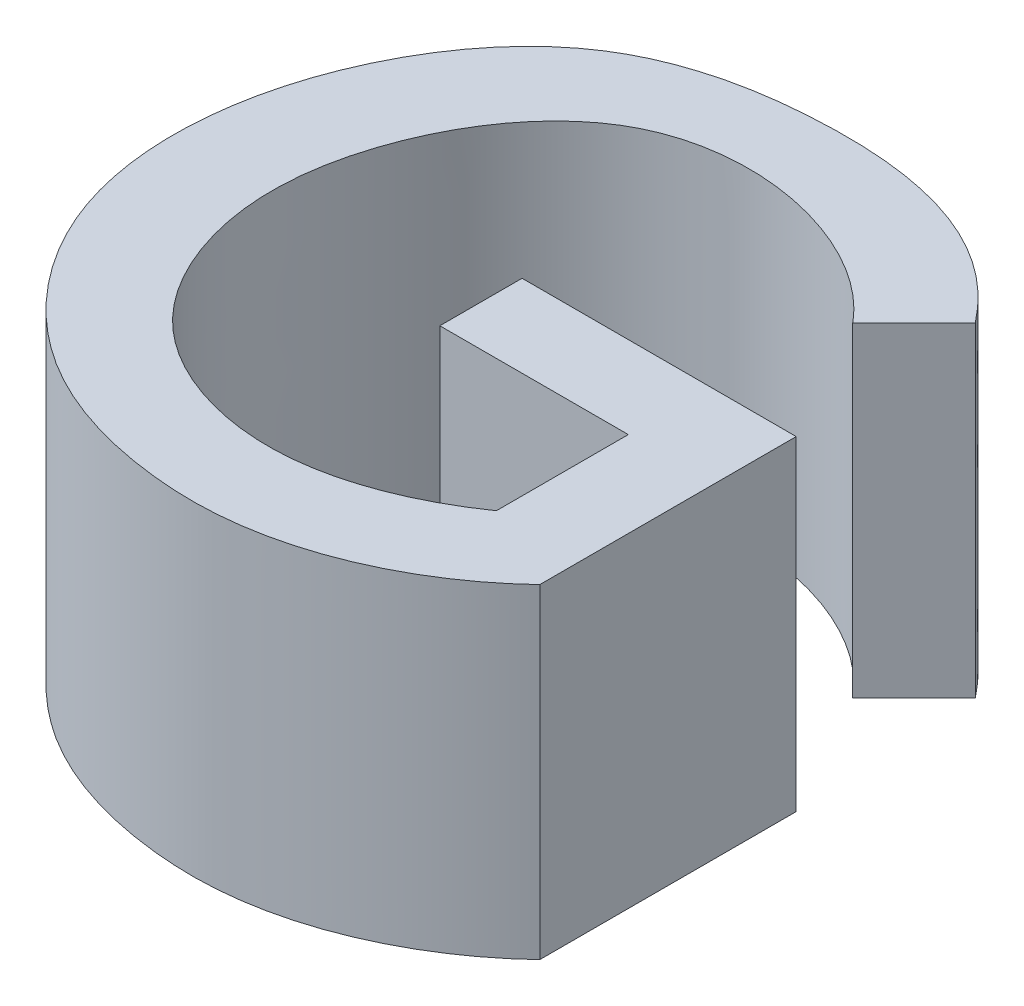
ISO-10303-21;
HEADER;
FILE_DESCRIPTION(('STEP AP214'),'2;1');
FILE_NAME('part.step','',(''),(''),'','','');
FILE_SCHEMA(('AUTOMOTIVE_DESIGN { 1 0 10303 214 1 1 1 1 }'));
ENDSEC;
DATA;
#1=APPLICATION_CONTEXT('core data for automotive mechanical design processes');
#2=APPLICATION_PROTOCOL_DEFINITION('international standard','automotive_design',2000,#1);
#3=PRODUCT_CONTEXT('',#1,'mechanical');
#4=PRODUCT('Part','Part','',(#3));
#5=PRODUCT_RELATED_PRODUCT_CATEGORY('part','',(#4));
#6=PRODUCT_DEFINITION_FORMATION('','',#4);
#7=PRODUCT_DEFINITION_CONTEXT('part definition',#1,'design');
#8=PRODUCT_DEFINITION('design','',#6,#7);
#9=PRODUCT_DEFINITION_SHAPE('','',#8);
#10=(LENGTH_UNIT() NAMED_UNIT(*) SI_UNIT(.MILLI.,.METRE.));
#11=(NAMED_UNIT(*) PLANE_ANGLE_UNIT() SI_UNIT($,.RADIAN.));
#12=(NAMED_UNIT(*) SI_UNIT($,.STERADIAN.) SOLID_ANGLE_UNIT());
#13=UNCERTAINTY_MEASURE_WITH_UNIT(LENGTH_MEASURE(1.E-05),#10,'distance_accuracy_value','');
#14=(GEOMETRIC_REPRESENTATION_CONTEXT(3) GLOBAL_UNCERTAINTY_ASSIGNED_CONTEXT((#13)) GLOBAL_UNIT_ASSIGNED_CONTEXT((#10,
#11,#12)) REPRESENTATION_CONTEXT('',''));
#15=CARTESIAN_POINT('',(0.,0.,0.));
#16=DIRECTION('',(0.,0.,1.));
#17=DIRECTION('',(1.,0.,0.));
#18=AXIS2_PLACEMENT_3D('',#15,#16,#17);
#19=CARTESIAN_POINT('',(126.088763028221,10.,-60.2562365635815));
#20=CARTESIAN_POINT('',(124.574663314239,10.,-59.2048276433992));
#21=CARTESIAN_POINT('',(121.10498408036,10.,-57.7919010808113));
#22=CARTESIAN_POINT('',(115.763779811495,10.,-59.6130976406927));
#23=CARTESIAN_POINT('',(113.852038341274,10.,-63.9996407660863));
#24=CARTESIAN_POINT('',(114.345164877795,10.,-68.6802438306113));
#25=CARTESIAN_POINT('',(118.173358570322,10.,-74.6612816437555));
#26=CARTESIAN_POINT('',(124.692015766744,10.,-73.0179646542755));
#27=CARTESIAN_POINT('',(126.563475649456,10.,-70.7531199206733));
#28=B_SPLINE_CURVE_WITH_KNOTS('',3,(#19,#20,#21,#22,#23,#24,#25,#26,#27),.UNSPECIFIED.,.F.,.F.,
(4,1,1,1,1,1,4),(0.,0.164827521055442,0.315061111689324,0.448478107291599,0.553523878175354,
0.730648717846891,1.),.UNSPECIFIED.);
#29=DIRECTION('',(0.,-1.,0.));
#30=VECTOR('',#29,1.);
#31=SURFACE_OF_LINEAR_EXTRUSION('',#28,#30);
#32=CARTESIAN_POINT('',(126.088763028221,0.,-60.2562365635815));
#33=CARTESIAN_POINT('',(124.574663314239,0.,-59.2048276433992));
#34=CARTESIAN_POINT('',(121.10498408036,0.,-57.7919010808113));
#35=CARTESIAN_POINT('',(115.763779811495,0.,-59.6130976406927));
#36=CARTESIAN_POINT('',(113.852038341274,0.,-63.9996407660863));
#37=CARTESIAN_POINT('',(114.345164877795,0.,-68.6802438306113));
#38=CARTESIAN_POINT('',(118.173358570322,0.,-74.6612816437555));
#39=CARTESIAN_POINT('',(124.692015766744,0.,-73.0179646542755));
#40=CARTESIAN_POINT('',(126.563475649456,0.,-70.7531199206733));
#41=B_SPLINE_CURVE_WITH_KNOTS('',3,(#32,#33,#34,#35,#36,#37,#38,#39,#40),.UNSPECIFIED.,.F.,.F.,
(4,1,1,1,1,1,4),(0.,0.164827521055442,0.315061111689324,0.448478107291599,0.553523878175354,
0.730648717846891,1.),.UNSPECIFIED.);
#42=CARTESIAN_POINT('',(126.088763028221,0.,-60.2562365635815));
#43=VERTEX_POINT('',#42);
#44=CARTESIAN_POINT('',(126.563475649456,0.,-70.7531199206733));
#45=VERTEX_POINT('',#44);
#46=EDGE_CURVE('E127',#43,#45,#41,.T.);
#47=ORIENTED_EDGE('',*,*,#46,.T.);
#48=DIRECTION('',(0.,-1.,0.));
#49=VECTOR('',#48,1.);
#50=CARTESIAN_POINT('',(126.563475649456,10.,-70.7531199206733));
#51=LINE('',#50,#49);
#52=CARTESIAN_POINT('',(126.563475649456,10.,-70.7531199206733));
#53=VERTEX_POINT('',#52);
#54=EDGE_CURVE('E11',#53,#45,#51,.T.);
#55=ORIENTED_EDGE('',*,*,#54,.F.);
#56=CARTESIAN_POINT('',(126.088763028221,10.,-60.2562365635815));
#57=VERTEX_POINT('',#56);
#58=EDGE_CURVE('E151',#57,#53,#28,.T.);
#59=ORIENTED_EDGE('',*,*,#58,.F.);
#60=DIRECTION('',(0.,-1.,0.));
#61=VECTOR('',#60,1.);
#62=CARTESIAN_POINT('',(126.088763028221,10.,-60.2562365635815));
#63=LINE('',#62,#61);
#64=EDGE_CURVE('E123',#57,#43,#63,.T.);
#65=ORIENTED_EDGE('',*,*,#64,.T.);
#66=EDGE_LOOP('',(#47,#55,#59,#65));
#67=FACE_BOUND('',#66,.T.);
#68=ADVANCED_FACE('F30',(#67),#31,.F.);
#69=CARTESIAN_POINT('',(126.563475649456,10.,-70.7531199206733));
#70=DIRECTION('',(-0.707106781186548,0.,-0.707106781186548));
#71=DIRECTION('',(-0.707106781186548,0.,0.707106781186548));
#72=AXIS2_PLACEMENT_3D('',#69,#70,#71);
#73=PLANE('',#72);
#74=DIRECTION('',(0.707106781186548,0.,-0.707106781186548));
#75=VECTOR('',#74,1.);
#76=CARTESIAN_POINT('',(126.563475649456,0.,-70.7531199206733));
#77=LINE('',#76,#75);
#78=CARTESIAN_POINT('',(128.450810729076,0.,-72.6404550002934));
#79=VERTEX_POINT('',#78);
#80=EDGE_CURVE('E132',#45,#79,#77,.T.);
#81=ORIENTED_EDGE('',*,*,#80,.T.);
#82=DIRECTION('',(0.,-1.,0.));
#83=VECTOR('',#82,1.);
#84=CARTESIAN_POINT('',(128.450810729076,10.,-72.6404550002934));
#85=LINE('',#84,#83);
#86=CARTESIAN_POINT('',(128.450810729076,10.,-72.6404550002934));
#87=VERTEX_POINT('',#86);
#88=EDGE_CURVE('E39',#87,#79,#85,.T.);
#89=ORIENTED_EDGE('',*,*,#88,.F.);
#90=DIRECTION('',(0.707106781186548,0.,-0.707106781186548));
#91=VECTOR('',#90,1.);
#92=CARTESIAN_POINT('',(126.563475649456,10.,-70.7531199206733));
#93=LINE('',#92,#91);
#94=EDGE_CURVE('E90',#53,#87,#93,.T.);
#95=ORIENTED_EDGE('',*,*,#94,.F.);
#96=ORIENTED_EDGE('',*,*,#54,.T.);
#97=EDGE_LOOP('',(#81,#89,#95,#96));
#98=FACE_BOUND('',#97,.T.);
#99=ADVANCED_FACE('F191',(#98),#73,.F.);
#100=CARTESIAN_POINT('',(128.450810729076,10.,-72.6404550002934));
#101=CARTESIAN_POINT('',(126.509324288055,10.,-75.1340630657012));
#102=CARTESIAN_POINT('',(121.90197684335,10.,-76.100955288035));
#103=CARTESIAN_POINT('',(115.302825634575,10.,-74.8408339160848));
#104=CARTESIAN_POINT('',(111.160173345142,10.,-69.5388788560056));
#105=CARTESIAN_POINT('',(110.473271602391,10.,-62.2671603593935));
#106=CARTESIAN_POINT('',(114.877298429999,10.,-57.1316917800918));
#107=CARTESIAN_POINT('',(118.959990216947,10.,-55.8972375236996));
#108=CARTESIAN_POINT('',(123.686757888279,10.,-55.7019912889211));
#109=CARTESIAN_POINT('',(126.893860275582,10.,-57.211286033428));
#110=CARTESIAN_POINT('',(128.726055368417,10.,-58.9556493619376));
#111=B_SPLINE_CURVE_WITH_KNOTS('',3,(#100,#101,#102,#103,#104,#105,#106,#107,#108,#109,#110),
.UNSPECIFIED.,.F.,.F.,(4,1,1,1,1,1,1,1,4),(0.,0.176143569913615,0.291482052381996,
0.399920387261598,0.578021461310155,0.703191610119415,0.79298493184036,0.83973642237001,1.),.UNSPECIFIED.);
#112=DIRECTION('',(0.,-1.,0.));
#113=VECTOR('',#112,1.);
#114=SURFACE_OF_LINEAR_EXTRUSION('',#111,#113);
#115=CARTESIAN_POINT('',(128.450810729076,0.,-72.6404550002934));
#116=CARTESIAN_POINT('',(126.509324288055,0.,-75.1340630657012));
#117=CARTESIAN_POINT('',(121.90197684335,0.,-76.100955288035));
#118=CARTESIAN_POINT('',(115.302825634575,0.,-74.8408339160848));
#119=CARTESIAN_POINT('',(111.160173345142,0.,-69.5388788560056));
#120=CARTESIAN_POINT('',(110.473271602391,0.,-62.2671603593935));
#121=CARTESIAN_POINT('',(114.877298429999,0.,-57.1316917800918));
#122=CARTESIAN_POINT('',(118.959990216947,0.,-55.8972375236996));
#123=CARTESIAN_POINT('',(123.686757888279,0.,-55.7019912889211));
#124=CARTESIAN_POINT('',(126.893860275582,0.,-57.211286033428));
#125=CARTESIAN_POINT('',(128.726055368417,0.,-58.9556493619376));
#126=B_SPLINE_CURVE_WITH_KNOTS('',3,(#115,#116,#117,#118,#119,#120,#121,#122,#123,#124,#125),
.UNSPECIFIED.,.F.,.F.,(4,1,1,1,1,1,1,1,4),(0.,0.176143569913615,0.291482052381996,
0.399920387261598,0.578021461310155,0.703191610119415,0.79298493184036,0.83973642237001,1.),.UNSPECIFIED.);
#127=CARTESIAN_POINT('',(128.726055368417,0.,-58.9556493619376));
#128=VERTEX_POINT('',#127);
#129=EDGE_CURVE('E137',#79,#128,#126,.T.);
#130=ORIENTED_EDGE('',*,*,#129,.T.);
#131=DIRECTION('',(0.,-1.,0.));
#132=VECTOR('',#131,1.);
#133=CARTESIAN_POINT('',(128.726055368417,10.,-58.9556493619376));
#134=LINE('',#133,#132);
#135=CARTESIAN_POINT('',(128.726055368417,10.,-58.9556493619376));
#136=VERTEX_POINT('',#135);
#137=EDGE_CURVE('E158',#136,#128,#134,.T.);
#138=ORIENTED_EDGE('',*,*,#137,.F.);
#139=EDGE_CURVE('E166',#87,#136,#111,.T.);
#140=ORIENTED_EDGE('',*,*,#139,.F.);
#141=ORIENTED_EDGE('',*,*,#88,.T.);
#142=EDGE_LOOP('',(#130,#138,#140,#141));
#143=FACE_BOUND('',#142,.T.);
#144=ADVANCED_FACE('F164',(#143),#114,.F.);
#145=CARTESIAN_POINT('',(128.726055368417,10.,-66.8499272571826));
#146=DIRECTION('',(-1.,0.,0.));
#147=DIRECTION('',(0.,0.,1.));
#148=AXIS2_PLACEMENT_3D('',#145,#146,#147);
#149=PLANE('',#148);
#150=DIRECTION('',(0.,0.,-1.));
#151=VECTOR('',#150,1.);
#152=CARTESIAN_POINT('',(128.726055368417,0.,-66.8499272571826));
#153=LINE('',#152,#151);
#154=CARTESIAN_POINT('',(128.726055368417,0.,-66.8499272571826));
#155=VERTEX_POINT('',#154);
#156=EDGE_CURVE('E141',#128,#155,#153,.T.);
#157=ORIENTED_EDGE('',*,*,#156,.T.);
#158=DIRECTION('',(0.,-1.,0.));
#159=VECTOR('',#158,1.);
#160=CARTESIAN_POINT('',(128.726055368417,10.,-66.8499272571826));
#161=LINE('',#160,#159);
#162=CARTESIAN_POINT('',(128.726055368417,10.,-66.8499272571826));
#163=VERTEX_POINT('',#162);
#164=EDGE_CURVE('E155',#163,#155,#161,.T.);
#165=ORIENTED_EDGE('',*,*,#164,.F.);
#166=DIRECTION('',(0.,0.,-1.));
#167=VECTOR('',#166,1.);
#168=CARTESIAN_POINT('',(128.726055368417,10.,-66.8499272571826));
#169=LINE('',#168,#167);
#170=EDGE_CURVE('E178',#136,#163,#169,.T.);
#171=ORIENTED_EDGE('',*,*,#170,.F.);
#172=ORIENTED_EDGE('',*,*,#137,.T.);
#173=EDGE_LOOP('',(#157,#165,#171,#172));
#174=FACE_BOUND('',#173,.T.);
#175=ADVANCED_FACE('F174',(#174),#149,.F.);
#176=CARTESIAN_POINT('',(120.286719879789,10.,-66.8499272571826));
#177=DIRECTION('',(0.,0.,1.));
#178=DIRECTION('',(1.,0.,0.));
#179=AXIS2_PLACEMENT_3D('',#176,#177,#178);
#180=PLANE('',#179);
#181=DIRECTION('',(-1.,0.,0.));
#182=VECTOR('',#181,1.);
#183=CARTESIAN_POINT('',(120.286719879789,0.,-66.8499272571826));
#184=LINE('',#183,#182);
#185=CARTESIAN_POINT('',(120.286719879789,0.,-66.8499272571826));
#186=VERTEX_POINT('',#185);
#187=EDGE_CURVE('E146',#155,#186,#184,.T.);
#188=ORIENTED_EDGE('',*,*,#187,.T.);
#189=DIRECTION('',(0.,-1.,0.));
#190=VECTOR('',#189,1.);
#191=CARTESIAN_POINT('',(120.286719879789,10.,-66.8499272571826));
#192=LINE('',#191,#190);
#193=CARTESIAN_POINT('',(120.286719879789,10.,-66.8499272571826));
#194=VERTEX_POINT('',#193);
#195=EDGE_CURVE('E118',#194,#186,#192,.T.);
#196=ORIENTED_EDGE('',*,*,#195,.F.);
#197=DIRECTION('',(-1.,0.,0.));
#198=VECTOR('',#197,1.);
#199=CARTESIAN_POINT('',(120.286719879789,10.,-66.8499272571826));
#200=LINE('',#199,#198);
#201=EDGE_CURVE('E109',#163,#194,#200,.T.);
#202=ORIENTED_EDGE('',*,*,#201,.F.);
#203=ORIENTED_EDGE('',*,*,#164,.T.);
#204=EDGE_LOOP('',(#188,#196,#202,#203));
#205=FACE_BOUND('',#204,.T.);
#206=ADVANCED_FACE('F177',(#205),#180,.F.);
#207=CARTESIAN_POINT('',(120.286719879789,10.,-64.3181266105941));
#208=DIRECTION('',(1.,0.,0.));
#209=DIRECTION('',(0.,0.,-1.));
#210=AXIS2_PLACEMENT_3D('',#207,#208,#209);
#211=PLANE('',#210);
#212=DIRECTION('',(0.,0.,1.));
#213=VECTOR('',#212,1.);
#214=CARTESIAN_POINT('',(120.286719879789,0.,-64.3181266105941));
#215=LINE('',#214,#213);
#216=CARTESIAN_POINT('',(120.286719879789,0.,-64.3181266105941));
#217=VERTEX_POINT('',#216);
#218=EDGE_CURVE('E117',#186,#217,#215,.T.);
#219=ORIENTED_EDGE('',*,*,#218,.T.);
#220=DIRECTION('',(0.,-1.,0.));
#221=VECTOR('',#220,1.);
#222=CARTESIAN_POINT('',(120.286719879789,10.,-64.3181266105941));
#223=LINE('',#222,#221);
#224=CARTESIAN_POINT('',(120.286719879789,10.,-64.3181266105941));
#225=VERTEX_POINT('',#224);
#226=EDGE_CURVE('E114',#225,#217,#223,.T.);
#227=ORIENTED_EDGE('',*,*,#226,.F.);
#228=DIRECTION('',(0.,0.,1.));
#229=VECTOR('',#228,1.);
#230=CARTESIAN_POINT('',(120.286719879789,10.,-64.3181266105941));
#231=LINE('',#230,#229);
#232=EDGE_CURVE('E103',#194,#225,#231,.T.);
#233=ORIENTED_EDGE('',*,*,#232,.F.);
#234=ORIENTED_EDGE('',*,*,#195,.T.);
#235=EDGE_LOOP('',(#219,#227,#233,#234));
#236=FACE_BOUND('',#235,.T.);
#237=ADVANCED_FACE('F115',(#236),#211,.F.);
#238=CARTESIAN_POINT('',(126.088763028221,10.,-64.3181266105941));
#239=DIRECTION('',(0.,0.,-1.));
#240=DIRECTION('',(-1.,0.,0.));
#241=AXIS2_PLACEMENT_3D('',#238,#239,#240);
#242=PLANE('',#241);
#243=DIRECTION('',(1.,0.,0.));
#244=VECTOR('',#243,1.);
#245=CARTESIAN_POINT('',(126.088763028221,0.,-64.3181266105941));
#246=LINE('',#245,#244);
#247=CARTESIAN_POINT('',(126.088763028221,0.,-64.3181266105941));
#248=VERTEX_POINT('',#247);
#249=EDGE_CURVE('E76',#217,#248,#246,.T.);
#250=ORIENTED_EDGE('',*,*,#249,.T.);
#251=DIRECTION('',(0.,-1.,0.));
#252=VECTOR('',#251,1.);
#253=CARTESIAN_POINT('',(126.088763028221,10.,-64.3181266105941));
#254=LINE('',#253,#252);
#255=CARTESIAN_POINT('',(126.088763028221,10.,-64.3181266105941));
#256=VERTEX_POINT('',#255);
#257=EDGE_CURVE('E119',#256,#248,#254,.T.);
#258=ORIENTED_EDGE('',*,*,#257,.F.);
#259=DIRECTION('',(1.,0.,0.));
#260=VECTOR('',#259,1.);
#261=CARTESIAN_POINT('',(126.088763028221,10.,-64.3181266105941));
#262=LINE('',#261,#260);
#263=EDGE_CURVE('E107',#225,#256,#262,.T.);
#264=ORIENTED_EDGE('',*,*,#263,.F.);
#265=ORIENTED_EDGE('',*,*,#226,.T.);
#266=EDGE_LOOP('',(#250,#258,#264,#265));
#267=FACE_BOUND('',#266,.T.);
#268=ADVANCED_FACE('F121',(#267),#242,.F.);
#269=CARTESIAN_POINT('',(126.088763028221,10.,-60.2562365635815));
#270=DIRECTION('',(1.,0.,0.));
#271=DIRECTION('',(0.,0.,-1.));
#272=AXIS2_PLACEMENT_3D('',#269,#270,#271);
#273=PLANE('',#272);
#274=DIRECTION('',(0.,0.,1.));
#275=VECTOR('',#274,1.);
#276=CARTESIAN_POINT('',(126.088763028221,0.,-60.2562365635815));
#277=LINE('',#276,#275);
#278=EDGE_CURVE('E82',#248,#43,#277,.T.);
#279=ORIENTED_EDGE('',*,*,#278,.T.);
#280=ORIENTED_EDGE('',*,*,#64,.F.);
#281=DIRECTION('',(0.,0.,1.));
#282=VECTOR('',#281,1.);
#283=CARTESIAN_POINT('',(126.088763028221,10.,-60.2562365635815));
#284=LINE('',#283,#282);
#285=EDGE_CURVE('E47',#256,#57,#284,.T.);
#286=ORIENTED_EDGE('',*,*,#285,.F.);
#287=ORIENTED_EDGE('',*,*,#257,.T.);
#288=EDGE_LOOP('',(#279,#280,#286,#287));
#289=FACE_BOUND('',#288,.T.);
#290=ADVANCED_FACE('F200',(#289),#273,.F.);
#291=CARTESIAN_POINT('',(114.133029059193,10.,-66.0579212090243));
#292=DIRECTION('',(0.,-1.,0.));
#293=DIRECTION('',(0.,0.,-1.));
#294=AXIS2_PLACEMENT_3D('',#291,#292,#293);
#295=PLANE('',#294);
#296=ORIENTED_EDGE('',*,*,#58,.T.);
#297=ORIENTED_EDGE('',*,*,#94,.T.);
#298=ORIENTED_EDGE('',*,*,#139,.T.);
#299=ORIENTED_EDGE('',*,*,#170,.T.);
#300=ORIENTED_EDGE('',*,*,#201,.T.);
#301=ORIENTED_EDGE('',*,*,#232,.T.);
#302=ORIENTED_EDGE('',*,*,#263,.T.);
#303=ORIENTED_EDGE('',*,*,#285,.T.);
#304=EDGE_LOOP('',(#296,#297,#298,#299,#300,#301,#302,#303));
#305=FACE_BOUND('',#304,.T.);
#306=ADVANCED_FACE('F105',(#305),#295,.F.);
#307=CARTESIAN_POINT('',(114.133029059193,0.,-66.0579212090243));
#308=DIRECTION('',(0.,-1.,0.));
#309=DIRECTION('',(0.,0.,-1.));
#310=AXIS2_PLACEMENT_3D('',#307,#308,#309);
#311=PLANE('',#310);
#312=ORIENTED_EDGE('',*,*,#46,.F.);
#313=ORIENTED_EDGE('',*,*,#278,.F.);
#314=ORIENTED_EDGE('',*,*,#249,.F.);
#315=ORIENTED_EDGE('',*,*,#218,.F.);
#316=ORIENTED_EDGE('',*,*,#187,.F.);
#317=ORIENTED_EDGE('',*,*,#156,.F.);
#318=ORIENTED_EDGE('',*,*,#129,.F.);
#319=ORIENTED_EDGE('',*,*,#80,.F.);
#320=EDGE_LOOP('',(#312,#313,#314,#315,#316,#317,#318,#319));
#321=FACE_BOUND('',#320,.T.);
#322=ADVANCED_FACE('F170',(#321),#311,.T.);
#323=CLOSED_SHELL('',(#68,#99,#144,#175,#206,#237,#268,#290,#306,#322));
#324=MANIFOLD_SOLID_BREP('B2',#323);
#325=ADVANCED_BREP_SHAPE_REPRESENTATION('',(#18,#324),#14);
#326=SHAPE_DEFINITION_REPRESENTATION(#9,#325);
ENDSEC;
END-ISO-10303-21;
